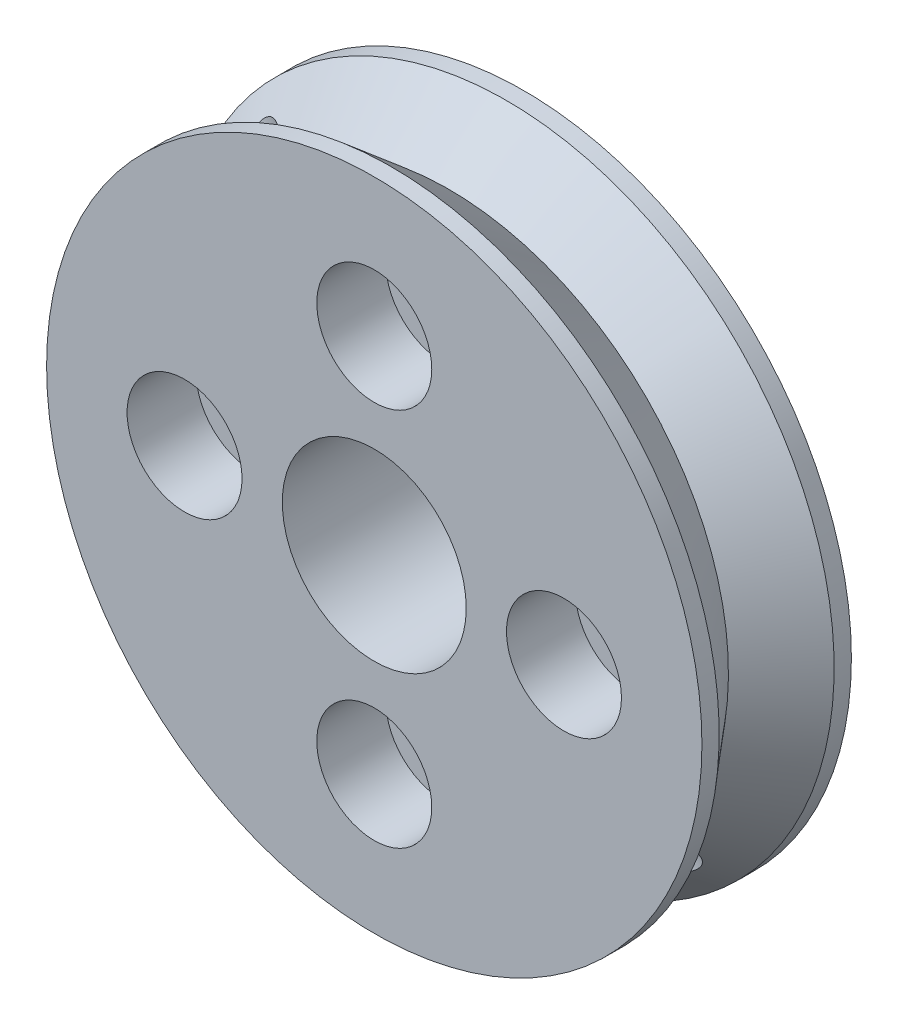
ISO-10303-21;
HEADER;
FILE_DESCRIPTION(('STEP AP214'),'2;1');
FILE_NAME('part.step','',(''),(''),'','','');
FILE_SCHEMA(('AUTOMOTIVE_DESIGN { 1 0 10303 214 1 1 1 1 }'));
ENDSEC;
DATA;
#1=APPLICATION_CONTEXT('core data for automotive mechanical design processes');
#2=APPLICATION_PROTOCOL_DEFINITION('international standard','automotive_design',2000,#1);
#3=PRODUCT_CONTEXT('',#1,'mechanical');
#4=PRODUCT('Part','Part','',(#3));
#5=PRODUCT_RELATED_PRODUCT_CATEGORY('part','',(#4));
#6=PRODUCT_DEFINITION_FORMATION('','',#4);
#7=PRODUCT_DEFINITION_CONTEXT('part definition',#1,'design');
#8=PRODUCT_DEFINITION('design','',#6,#7);
#9=PRODUCT_DEFINITION_SHAPE('','',#8);
#10=(LENGTH_UNIT() NAMED_UNIT(*) SI_UNIT(.MILLI.,.METRE.));
#11=(NAMED_UNIT(*) PLANE_ANGLE_UNIT() SI_UNIT($,.RADIAN.));
#12=(NAMED_UNIT(*) SI_UNIT($,.STERADIAN.) SOLID_ANGLE_UNIT());
#13=UNCERTAINTY_MEASURE_WITH_UNIT(LENGTH_MEASURE(1.E-05),#10,'distance_accuracy_value','');
#14=(GEOMETRIC_REPRESENTATION_CONTEXT(3) GLOBAL_UNCERTAINTY_ASSIGNED_CONTEXT((#13)) GLOBAL_UNIT_ASSIGNED_CONTEXT((#10,
#11,#12)) REPRESENTATION_CONTEXT('',''));
#15=CARTESIAN_POINT('',(0.,0.,0.));
#16=DIRECTION('',(0.,0.,1.));
#17=DIRECTION('',(1.,0.,0.));
#18=AXIS2_PLACEMENT_3D('',#15,#16,#17);
#19=CARTESIAN_POINT('',(0.,-8.25,3.25));
#20=DIRECTION('',(0.,0.,-1.));
#21=DIRECTION('',(-1.,0.,0.));
#22=AXIS2_PLACEMENT_3D('',#19,#20,#21);
#23=CYLINDRICAL_SURFACE('',#22,1.7);
#24=CARTESIAN_POINT('',(0.,-8.25,-3.25));
#25=DIRECTION('',(0.,0.,1.));
#26=DIRECTION('',(1.,0.,0.));
#27=AXIS2_PLACEMENT_3D('',#24,#25,#26);
#28=CIRCLE('',#27,1.7);
#29=CARTESIAN_POINT('',(1.7,-8.25,-3.25));
#30=VERTEX_POINT('',#29);
#31=EDGE_CURVE('E138',#30,#30,#28,.T.);
#32=ORIENTED_EDGE('',*,*,#31,.F.);
#33=EDGE_LOOP('',(#32));
#34=FACE_BOUND('',#33,.T.);
#35=CARTESIAN_POINT('',(0.,-8.25,0.25));
#36=DIRECTION('',(0.,0.,1.));
#37=DIRECTION('',(1.,0.,0.));
#38=AXIS2_PLACEMENT_3D('',#35,#36,#37);
#39=CIRCLE('',#38,1.7);
#40=CARTESIAN_POINT('',(1.7,-8.25,0.25));
#41=VERTEX_POINT('',#40);
#42=EDGE_CURVE('E43',#41,#41,#39,.F.);
#43=ORIENTED_EDGE('',*,*,#42,.F.);
#44=EDGE_LOOP('',(#43));
#45=FACE_BOUND('',#44,.T.);
#46=ADVANCED_FACE('F39',(#34,#45),#23,.F.);
#47=CARTESIAN_POINT('',(-8.25,0.,3.25));
#48=DIRECTION('',(0.,0.,-1.));
#49=DIRECTION('',(-1.,0.,0.));
#50=AXIS2_PLACEMENT_3D('',#47,#48,#49);
#51=CYLINDRICAL_SURFACE('',#50,1.7);
#52=CARTESIAN_POINT('',(-8.25,0.,-3.25));
#53=DIRECTION('',(0.,0.,1.));
#54=DIRECTION('',(1.,0.,0.));
#55=AXIS2_PLACEMENT_3D('',#52,#53,#54);
#56=CIRCLE('',#55,1.7);
#57=CARTESIAN_POINT('',(-6.55,0.,-3.25));
#58=VERTEX_POINT('',#57);
#59=EDGE_CURVE('E135',#58,#58,#56,.T.);
#60=ORIENTED_EDGE('',*,*,#59,.F.);
#61=EDGE_LOOP('',(#60));
#62=FACE_BOUND('',#61,.T.);
#63=CARTESIAN_POINT('',(-8.25,0.,0.25));
#64=DIRECTION('',(0.,0.,1.));
#65=DIRECTION('',(1.,0.,0.));
#66=AXIS2_PLACEMENT_3D('',#63,#64,#65);
#67=CIRCLE('',#66,1.7);
#68=CARTESIAN_POINT('',(-6.55,0.,0.25));
#69=VERTEX_POINT('',#68);
#70=EDGE_CURVE('E185',#69,#69,#67,.F.);
#71=ORIENTED_EDGE('',*,*,#70,.F.);
#72=EDGE_LOOP('',(#71));
#73=FACE_BOUND('',#72,.T.);
#74=ADVANCED_FACE('F101',(#62,#73),#51,.F.);
#75=CARTESIAN_POINT('',(0.,8.25,3.25));
#76=DIRECTION('',(0.,0.,-1.));
#77=DIRECTION('',(-1.,0.,0.));
#78=AXIS2_PLACEMENT_3D('',#75,#76,#77);
#79=CYLINDRICAL_SURFACE('',#78,1.7);
#80=CARTESIAN_POINT('',(0.,8.25,-3.25));
#81=DIRECTION('',(0.,0.,1.));
#82=DIRECTION('',(1.,0.,0.));
#83=AXIS2_PLACEMENT_3D('',#80,#81,#82);
#84=CIRCLE('',#83,1.7);
#85=CARTESIAN_POINT('',(1.7,8.25,-3.25));
#86=VERTEX_POINT('',#85);
#87=EDGE_CURVE('E131',#86,#86,#84,.T.);
#88=ORIENTED_EDGE('',*,*,#87,.F.);
#89=EDGE_LOOP('',(#88));
#90=FACE_BOUND('',#89,.T.);
#91=CARTESIAN_POINT('',(0.,8.25,0.25));
#92=DIRECTION('',(0.,0.,1.));
#93=DIRECTION('',(1.,0.,0.));
#94=AXIS2_PLACEMENT_3D('',#91,#92,#93);
#95=CIRCLE('',#94,1.7);
#96=CARTESIAN_POINT('',(1.7,8.25,0.25));
#97=VERTEX_POINT('',#96);
#98=EDGE_CURVE('E182',#97,#97,#95,.F.);
#99=ORIENTED_EDGE('',*,*,#98,.F.);
#100=EDGE_LOOP('',(#99));
#101=FACE_BOUND('',#100,.T.);
#102=ADVANCED_FACE('F107',(#90,#101),#79,.F.);
#103=CARTESIAN_POINT('',(8.25,0.,3.25));
#104=DIRECTION('',(0.,0.,-1.));
#105=DIRECTION('',(-1.,0.,0.));
#106=AXIS2_PLACEMENT_3D('',#103,#104,#105);
#107=CYLINDRICAL_SURFACE('',#106,1.7);
#108=CARTESIAN_POINT('',(8.25,0.,-3.25));
#109=DIRECTION('',(0.,0.,1.));
#110=DIRECTION('',(1.,0.,0.));
#111=AXIS2_PLACEMENT_3D('',#108,#109,#110);
#112=CIRCLE('',#111,1.7);
#113=CARTESIAN_POINT('',(9.95,0.,-3.25));
#114=VERTEX_POINT('',#113);
#115=EDGE_CURVE('E127',#114,#114,#112,.T.);
#116=ORIENTED_EDGE('',*,*,#115,.F.);
#117=EDGE_LOOP('',(#116));
#118=FACE_BOUND('',#117,.T.);
#119=CARTESIAN_POINT('',(8.25,0.,0.25));
#120=DIRECTION('',(0.,0.,1.));
#121=DIRECTION('',(1.,0.,0.));
#122=AXIS2_PLACEMENT_3D('',#119,#120,#121);
#123=CIRCLE('',#122,1.7);
#124=CARTESIAN_POINT('',(9.95,0.,0.25));
#125=VERTEX_POINT('',#124);
#126=EDGE_CURVE('E186',#125,#125,#123,.F.);
#127=ORIENTED_EDGE('',*,*,#126,.F.);
#128=EDGE_LOOP('',(#127));
#129=FACE_BOUND('',#128,.T.);
#130=ADVANCED_FACE('F171',(#118,#129),#107,.F.);
#131=CARTESIAN_POINT('',(0.,0.,3.25));
#132=DIRECTION('',(0.,0.,-1.));
#133=DIRECTION('',(-1.,0.,0.));
#134=AXIS2_PLACEMENT_3D('',#131,#132,#133);
#135=CYLINDRICAL_SURFACE('',#134,14.25);
#136=CARTESIAN_POINT('',(0.,0.,-3.25));
#137=DIRECTION('',(0.,0.,1.));
#138=DIRECTION('',(1.,0.,0.));
#139=AXIS2_PLACEMENT_3D('',#136,#137,#138);
#140=CIRCLE('',#139,14.25);
#141=CARTESIAN_POINT('',(14.25,0.,-3.25));
#142=VERTEX_POINT('',#141);
#143=EDGE_CURVE('E141',#142,#142,#140,.T.);
#144=ORIENTED_EDGE('',*,*,#143,.T.);
#145=EDGE_LOOP('',(#144));
#146=FACE_BOUND('',#145,.T.);
#147=CARTESIAN_POINT('',(0.,0.,-2.5));
#148=DIRECTION('',(0.,0.,-1.));
#149=DIRECTION('',(-1.,0.,0.));
#150=AXIS2_PLACEMENT_3D('',#147,#148,#149);
#151=CIRCLE('',#150,14.25);
#152=CARTESIAN_POINT('',(-14.25,0.,-2.5));
#153=VERTEX_POINT('',#152);
#154=EDGE_CURVE('E236',#153,#153,#151,.T.);
#155=ORIENTED_EDGE('',*,*,#154,.T.);
#156=EDGE_LOOP('',(#155));
#157=FACE_BOUND('',#156,.T.);
#158=ADVANCED_FACE('F41',(#146,#157),#135,.T.);
#159=CARTESIAN_POINT('',(0.,0.,3.25));
#160=DIRECTION('',(0.,0.,1.));
#161=DIRECTION('',(1.,0.,0.));
#162=AXIS2_PLACEMENT_3D('',#159,#160,#161);
#163=CIRCLE('',#162,14.25);
#164=CARTESIAN_POINT('',(14.25,0.,3.25));
#165=VERTEX_POINT('',#164);
#166=EDGE_CURVE('E71',#165,#165,#163,.T.);
#167=ORIENTED_EDGE('',*,*,#166,.F.);
#168=EDGE_LOOP('',(#167));
#169=FACE_BOUND('',#168,.T.);
#170=CARTESIAN_POINT('',(0.,0.,2.5));
#171=DIRECTION('',(0.,0.,-1.));
#172=DIRECTION('',(-1.,0.,0.));
#173=AXIS2_PLACEMENT_3D('',#170,#171,#172);
#174=CIRCLE('',#173,14.25);
#175=CARTESIAN_POINT('',(-14.25,0.,2.5));
#176=VERTEX_POINT('',#175);
#177=EDGE_CURVE('E79',#176,#176,#174,.T.);
#178=ORIENTED_EDGE('',*,*,#177,.F.);
#179=EDGE_LOOP('',(#178));
#180=FACE_BOUND('',#179,.T.);
#181=ADVANCED_FACE('F94',(#169,#180),#135,.T.);
#182=CARTESIAN_POINT('',(-14.2499999999999,14.2500000000001,0.));
#183=DIRECTION('',(0.707106781186542,-0.707106781186554,0.));
#184=DIRECTION('',(0.707106781186554,0.707106781186542,0.));
#185=AXIS2_PLACEMENT_3D('',#182,#183,#184);
#186=CYLINDRICAL_SURFACE('',#185,1.4);
#187=CARTESIAN_POINT('',(3.63947775355951,-1.65957876623723,0.));
#188=CARTESIAN_POINT('',(3.63947788611536,-1.65957716975627,0.0760060913772673));
#189=CARTESIAN_POINT('',(3.63673946082005,-1.66562327320794,0.152003666512723));
#190=CARTESIAN_POINT('',(3.62575133125318,-1.68940690467713,0.301731690751213));
#191=CARTESIAN_POINT('',(3.61750116905998,-1.70714540411112,0.375461950950603));
#192=CARTESIAN_POINT('',(3.59540903450762,-1.75319076836715,0.518458673443775));
#193=CARTESIAN_POINT('',(3.58157894045541,-1.7814751738971,0.587734257722022));
#194=CARTESIAN_POINT('',(3.54816192307589,-1.84713271589594,0.720330706961884));
#195=CARTESIAN_POINT('',(3.52857353591859,-1.88450816300364,0.783650052363904));
#196=CARTESIAN_POINT('',(3.48255926605917,-1.96828560280359,0.905271446713055));
#197=CARTESIAN_POINT('',(3.45589525150277,-2.01498423610397,0.963279137534918));
#198=CARTESIAN_POINT('',(3.39596565053636,-2.11442276463167,1.06997499761331));
#199=CARTESIAN_POINT('',(3.36269887925282,-2.16716374344676,1.11866149108331));
#200=CARTESIAN_POINT('',(3.28848514892996,-2.27825572753737,1.20670005156797));
#201=CARTESIAN_POINT('',(3.24734285642484,-2.33672532769894,1.24573923603048));
#202=CARTESIAN_POINT('',(3.15840699983615,-2.4555986165656,1.31129584709942));
#203=CARTESIAN_POINT('',(3.1106154304801,-2.51600172106694,1.33781701856315));
#204=CARTESIAN_POINT('',(3.0111834618099,-2.63410384668441,1.37657343099056));
#205=CARTESIAN_POINT('',(2.9597587299749,-2.69181829964504,1.38931389802083));
#206=CARTESIAN_POINT('',(2.85286862465806,-2.80485007673732,1.40175847012769));
#207=CARTESIAN_POINT('',(2.79740440165374,-2.86016807629417,1.40146627262204));
#208=CARTESIAN_POINT('',(2.68663329450503,-2.96437835617514,1.38816415346179));
#209=CARTESIAN_POINT('',(2.63142305198567,-3.01344496571013,1.37570398786468));
#210=CARTESIAN_POINT('',(2.52065825099104,-3.10669051060959,1.33933478883097));
#211=CARTESIAN_POINT('',(2.46510366891711,-3.15086910698329,1.31542496195572));
#212=CARTESIAN_POINT('',(2.35472889996983,-3.23420842028166,1.25654027871546));
#213=CARTESIAN_POINT('',(2.29992937945607,-3.27329160946798,1.22141749919883));
#214=CARTESIAN_POINT('',(2.19372187436958,-3.34540149514565,1.14122901867042));
#215=CARTESIAN_POINT('',(2.14231490308241,-3.37842638734163,1.09616036433163));
#216=CARTESIAN_POINT('',(2.04218698102348,-3.43992773804009,0.994635141240734));
#217=CARTESIAN_POINT('',(1.9937412281221,-3.46808184037123,0.937711185982945));
#218=CARTESIAN_POINT('',(1.90464439807046,-3.5178031795848,0.815478406493404));
#219=CARTESIAN_POINT('',(1.86399479264564,-3.53936917324513,0.750168002978949));
#220=CARTESIAN_POINT('',(1.79184441999284,-3.57644703788225,0.611551972355263));
#221=CARTESIAN_POINT('',(1.76051230183362,-3.59184887259228,0.538128550796498));
#222=CARTESIAN_POINT('',(1.7098158670291,-3.61625922983092,0.38626346059649));
#223=CARTESIAN_POINT('',(1.6904459109066,-3.62527076531872,0.307824175926177));
#224=CARTESIAN_POINT('',(1.66560070124844,-3.63675040530604,0.152281300172023));
#225=CARTESIAN_POINT('',(1.65948951557399,-3.639518255677,0.0753014409578754));
#226=CARTESIAN_POINT('',(1.65966994027411,-3.63943637435514,-0.0786316642045612));
#227=CARTESIAN_POINT('',(1.66595899093495,-3.63658780203009,-0.155584912366397));
#228=CARTESIAN_POINT('',(1.69002551657347,-3.62546210440793,-0.304127247344445));
#229=CARTESIAN_POINT('',(1.70734274764287,-3.61740226584294,-0.375808346770403));
#230=CARTESIAN_POINT('',(1.75203214113332,-3.59596902530902,-0.515121227583017));
#231=CARTESIAN_POINT('',(1.77940619770845,-3.58259462232903,-0.582752243363609));
#232=CARTESIAN_POINT('',(1.84392358703916,-3.54983009794742,-0.714603777668174));
#233=CARTESIAN_POINT('',(1.88136816697597,-3.53025042751184,-0.778629411348126));
#234=CARTESIAN_POINT('',(1.96383687670407,-3.48504701236031,-0.899243379425569));
#235=CARTESIAN_POINT('',(2.00886345640405,-3.45942131296415,-0.955829299332018));
#236=CARTESIAN_POINT('',(2.10729098178688,-3.40040966502153,-1.06311491416967));
#237=CARTESIAN_POINT('',(2.16101251484198,-3.36667985767456,-1.11333287705775));
#238=CARTESIAN_POINT('',(2.27271128094015,-3.29230604884668,-1.20272072106339));
#239=CARTESIAN_POINT('',(2.3306884150722,-3.25166220803664,-1.24189085885819));
#240=CARTESIAN_POINT('',(2.44831627393176,-3.16403061699532,-1.30774170435537));
#241=CARTESIAN_POINT('',(2.50795566169806,-3.11708009609219,-1.33449188413042));
#242=CARTESIAN_POINT('',(2.62693128260439,-3.01748884388866,-1.3748102323871));
#243=CARTESIAN_POINT('',(2.68626762817928,-2.96485041223458,-1.38838370627018));
#244=CARTESIAN_POINT('',(2.79946980482254,-2.85809567944846,-1.40144816504143));
#245=CARTESIAN_POINT('',(2.85346003008803,-2.80419469303981,-1.40162765138887));
#246=CARTESIAN_POINT('',(2.95760622195815,-2.69412405133208,-1.38962556150099));
#247=CARTESIAN_POINT('',(3.00776255461261,-2.63795461340329,-1.37744516694324));
#248=CARTESIAN_POINT('',(3.10212408165155,-2.52627688770917,-1.34153812325355));
#249=CARTESIAN_POINT('',(3.14642422707418,-2.47077631010416,-1.31803520806681));
#250=CARTESIAN_POINT('',(3.22947510786148,-2.36119095730419,-1.26036291606221));
#251=CARTESIAN_POINT('',(3.26822480956707,-2.30710644735211,-1.22619155621779));
#252=CARTESIAN_POINT('',(3.34125032246574,-2.20009278303812,-1.14661824681527));
#253=CARTESIAN_POINT('',(3.37529145903147,-2.14729185020974,-1.10082884760398));
#254=CARTESIAN_POINT('',(3.43698795785791,-2.04709119745253,-0.999958933749432));
#255=CARTESIAN_POINT('',(3.46464117278362,-1.99969329648676,-0.94487530553615));
#256=CARTESIAN_POINT('',(3.5147829202205,-1.91024847309414,-0.824065163914138));
#257=CARTESIAN_POINT('',(3.53698794089197,-1.86853217790949,-0.75797493356523));
#258=CARTESIAN_POINT('',(3.57480022824283,-1.7951366166433,-0.618700914273428));
#259=CARTESIAN_POINT('',(3.59040834885774,-1.76345605162006,-0.545518044945527));
#260=CARTESIAN_POINT('',(3.61510049733565,-1.71226577384796,-0.394878281224767));
#261=CARTESIAN_POINT('',(3.62425491899729,-1.69262505466233,-0.317477749380293));
#262=CARTESIAN_POINT('',(3.63644210279996,-1.66628529708503,-0.160047533869541));
#263=CARTESIAN_POINT('',(3.639477614005,-1.65958044700889,-0.0800190473048831));
#264=CARTESIAN_POINT('',(3.63947775355951,-1.65957876623723,0.));
#265=B_SPLINE_CURVE_WITH_KNOTS('',3,(#187,#188,#189,#190,#191,#192,#193,#194,#195,#196,#197,
#198,#199,#200,#201,#202,#203,#204,#205,#206,#207,#208,#209,#210,#211,#212,#213,#214,#215,#216,
#217,#218,#219,#220,#221,#222,#223,#224,#225,#226,#227,#228,#229,#230,#231,#232,#233,#234,#235,
#236,#237,#238,#239,#240,#241,#242,#243,#244,#245,#246,#247,#248,#249,#250,#251,#252,#253,#254,
#255,#256,#257,#258,#259,#260,#261,#262,#263,#264),.UNSPECIFIED.,.T.,.F.,(4,2,2,2,2,2,2,2,2,2,2,
2,2,2,2,2,2,2,2,2,2,2,2,2,2,2,2,2,2,2,2,2,2,2,2,2,2,2,4),(0.,0.227721308475359,
0.455461538659763,0.682719502323081,0.910035287830709,1.14627052827175,1.3825481998336,
1.62570198917555,1.8687829910648,2.10261389235607,2.33637845533114,2.56004796521567,
2.78373297719376,3.01050009443987,3.23733463871139,3.47586603961667,3.71444242529663,
3.95710565561087,4.19965439654246,4.43028591348695,4.66086982739881,4.88241035498192,
5.10399263005356,5.3331293378953,5.56234022735559,5.80390693258595,6.04546802496657,
6.2856611448589,6.52575751446145,6.75350304980482,6.9812268133821,7.20462462215142,
7.42806398035223,7.66025483630845,7.89252363128308,8.13509557321962,8.37763610581469,
8.61748838623404,8.85723288335298),.UNSPECIFIED.);
#266=CARTESIAN_POINT('',(3.63947775355951,-1.65957876623723,0.));
#267=VERTEX_POINT('',#266);
#268=EDGE_CURVE('E158',#267,#267,#265,.T.);
#269=ORIENTED_EDGE('',*,*,#268,.F.);
#270=EDGE_LOOP('',(#269));
#271=FACE_BOUND('',#270,.T.);
#272=CARTESIAN_POINT('',(9.43753108702619,-7.4675849151729,0.14019999999997));
#273=CARTESIAN_POINT('',(9.46734965577651,-7.49098429448374,0.0950264309316864));
#274=CARTESIAN_POINT('',(9.4957823363307,-7.51611769843548,0.0498705369338458));
#275=CARTESIAN_POINT('',(9.54978019748563,-7.5696704756696,-0.040200520438273));
#276=CARTESIAN_POINT('',(9.57534564227704,-7.59808954571578,-0.0851157056280187));
#277=CARTESIAN_POINT('',(9.64798525452429,-7.6884817986624,-0.219909502325278));
#278=CARTESIAN_POINT('',(9.69052924256376,-7.75521580119698,-0.309117697395798));
#279=CARTESIAN_POINT('',(9.76718340475337,-7.90979430672398,-0.495783180606125));
#280=CARTESIAN_POINT('',(9.79933475899052,-7.99927909967803,-0.59269230975932));
#281=CARTESIAN_POINT('',(9.84333232059952,-8.19070447707615,-0.778252106736865));
#282=CARTESIAN_POINT('',(9.85525013262265,-8.29259976360864,-0.866930843111174));
#283=CARTESIAN_POINT('',(9.8545926939759,-8.4654393554997,-0.9999521089026));
#284=CARTESIAN_POINT('',(9.84962826271485,-8.5333575576846,-1.04830048747714));
#285=CARTESIAN_POINT('',(9.82888242859464,-8.67190468610074,-1.13836846417113));
#286=CARTESIAN_POINT('',(9.81311797574277,-8.74252920119541,-1.18009832346961));
#287=CARTESIAN_POINT('',(9.77366804064787,-8.87083532604728,-1.24745626487307));
#288=CARTESIAN_POINT('',(9.75212765519881,-8.92835421234267,-1.27463740246337));
#289=CARTESIAN_POINT('',(9.70061916891676,-9.04257642972078,-1.32192001269676));
#290=CARTESIAN_POINT('',(9.67065538504984,-9.09928016296081,-1.34202509993934));
#291=CARTESIAN_POINT('',(9.60199584093452,-9.21040850248468,-1.3739188863474));
#292=CARTESIAN_POINT('',(9.56323196187327,-9.2648111769175,-1.38563957853349));
#293=CARTESIAN_POINT('',(9.47796705743104,-9.36853152352961,-1.39946843186714));
#294=CARTESIAN_POINT('',(9.43147213365703,-9.41785315651427,-1.40158413662394));
#295=CARTESIAN_POINT('',(9.33900793552611,-9.50339491415079,-1.3963989308437));
#296=CARTESIAN_POINT('',(9.29376615594782,-9.54048490321998,-1.39029411430235));
#297=CARTESIAN_POINT('',(9.20022780912705,-9.60847761977367,-1.37113813985493));
#298=CARTESIAN_POINT('',(9.15193088154649,-9.63937961562086,-1.35808616121783));
#299=CARTESIAN_POINT('',(9.05302425400683,-9.69506326468632,-1.32559218958881));
#300=CARTESIAN_POINT('',(9.00239120670539,-9.71974993238832,-1.30606050546355));
#301=CARTESIAN_POINT('',(8.90072963567944,-9.76255224180034,-1.26164141764392));
#302=CARTESIAN_POINT('',(8.84970093135849,-9.78066467741327,-1.236751410223));
#303=CARTESIAN_POINT('',(8.72341297073871,-9.81804410301845,-1.1693180906493));
#304=CARTESIAN_POINT('',(8.6484738160744,-9.8335660392111,-1.12408540774541));
#305=CARTESIAN_POINT('',(8.50182155387668,-9.85262558630537,-1.0264064403747));
#306=CARTESIAN_POINT('',(8.43011615618018,-9.85613591092636,-0.973944013019302));
#307=CARTESIAN_POINT('',(8.26853973821625,-9.85220709115613,-0.845797110092847));
#308=CARTESIAN_POINT('',(8.1803563697062,-9.84083041709052,-0.768113552399643));
#309=CARTESIAN_POINT('',(8.01342491915921,-9.80270723899653,-0.606510228120875));
#310=CARTESIAN_POINT('',(7.93469363281545,-9.77593385076939,-0.522579777579706));
#311=CARTESIAN_POINT('',(7.82158236264099,-9.72434061202671,-0.39007958229217));
#312=CARTESIAN_POINT('',(7.78336636208185,-9.70421108492633,-0.342863171327817));
#313=CARTESIAN_POINT('',(7.71030624015635,-9.66023003162617,-0.247539703294428));
#314=CARTESIAN_POINT('',(7.67546238391243,-9.63637821315945,-0.199432576549792));
#315=CARTESIAN_POINT('',(7.60954990672717,-9.58528393936149,-0.102881798101448));
#316=CARTESIAN_POINT('',(7.57846244978679,-9.5580599170859,-0.0544412332825799));
#317=CARTESIAN_POINT('',(7.52010236698921,-9.50026824548891,0.0427312254067125));
#318=CARTESIAN_POINT('',(7.49282928803658,-9.46970099406697,0.0914630839571558));
#319=CARTESIAN_POINT('',(7.46758491517272,-9.4375310870263,0.140200000000001));
#320=B_SPLINE_CURVE_WITH_KNOTS('',3,(#272,#273,#274,#275,#276,#277,#278,#279,#280,#281,#282,
#283,#284,#285,#286,#287,#288,#289,#290,#291,#292,#293,#294,#295,#296,#297,#298,#299,#300,#301,
#302,#303,#304,#305,#306,#307,#308,#309,#310,#311,#312,#313,#314,#315,#316,#317,#318,#319),
.UNSPECIFIED.,.F.,.F.,(4,2,2,2,2,2,2,2,2,2,2,2,2,2,2,2,2,2,2,2,2,2,2,4),(0.,0.176815457380836,
0.353614609358182,0.710000790584395,1.11529838666654,1.51915865868001,1.7689131605813,
2.01827658254899,2.21899547986618,2.41961169630763,2.62183723518224,2.82390392172509,
2.99952666227456,3.17517015533208,3.35335405464546,3.53162473363866,3.79683871151728,
4.06265476647018,4.41502523321876,4.76801285023159,4.95981851604573,5.15163924964514,
5.3424542522406,5.53324656936292),.UNSPECIFIED.);
#321=CARTESIAN_POINT('',(9.52567449135846,-7.54577550403627,0.));
#322=VERTEX_POINT('',#321);
#323=CARTESIAN_POINT('',(7.5457755040358,-9.52567449135878,0.));
#324=VERTEX_POINT('',#323);
#325=EDGE_CURVE('E76',#322,#324,#320,.T.);
#326=ORIENTED_EDGE('',*,*,#325,.F.);
#327=CARTESIAN_POINT('',(7.46758491517272,-9.4375310870263,-0.140199999999999));
#328=CARTESIAN_POINT('',(7.49098429448356,-9.46734965577662,-0.0950264309317154));
#329=CARTESIAN_POINT('',(7.5161176984353,-9.49578233633081,-0.0498705369338746));
#330=CARTESIAN_POINT('',(7.56967047566942,-9.54978019748575,0.040200520438244));
#331=CARTESIAN_POINT('',(7.5980895457156,-9.57534564227715,0.0851157056279895));
#332=CARTESIAN_POINT('',(7.68848179866221,-9.64798525452441,0.21990950232525));
#333=CARTESIAN_POINT('',(7.75521580119679,-9.69052924256387,0.309117697395771));
#334=CARTESIAN_POINT('',(7.90979430672379,-9.7671834047535,0.495783180606099));
#335=CARTESIAN_POINT('',(7.99927909967784,-9.79933475899065,0.592692309759294));
#336=CARTESIAN_POINT('',(8.19070447707595,-9.84333232059965,0.778252106736838));
#337=CARTESIAN_POINT('',(8.29259976360844,-9.85525013262278,0.866930843111146));
#338=CARTESIAN_POINT('',(8.4654393554995,-9.85459269397605,0.999952108902576));
#339=CARTESIAN_POINT('',(8.5333575576844,-9.849628262715,1.04830048747712));
#340=CARTESIAN_POINT('',(8.67190468610054,-9.82888242859479,1.13836846417111));
#341=CARTESIAN_POINT('',(8.74252920119521,-9.81311797574293,1.18009832346959));
#342=CARTESIAN_POINT('',(8.87083532604709,-9.77366804064803,1.24745626487306));
#343=CARTESIAN_POINT('',(8.92835421234248,-9.75212765519897,1.27463740246336));
#344=CARTESIAN_POINT('',(9.04257642972058,-9.70061916891693,1.32192001269675));
#345=CARTESIAN_POINT('',(9.09928016296061,-9.67065538505001,1.34202509993933));
#346=CARTESIAN_POINT('',(9.21040850248449,-9.60199584093469,1.3739188863474));
#347=CARTESIAN_POINT('',(9.26481117691731,-9.56323196187345,1.38563957853348));
#348=CARTESIAN_POINT('',(9.36853152352942,-9.47796705743122,1.39946843186714));
#349=CARTESIAN_POINT('',(9.41785315651409,-9.43147213365721,1.40158413662394));
#350=CARTESIAN_POINT('',(9.5033949141506,-9.3390079355263,1.3963989308437));
#351=CARTESIAN_POINT('',(9.5404849032198,-9.293766155948,1.39029411430235));
#352=CARTESIAN_POINT('',(9.6084776197735,-9.20022780912723,1.37113813985494));
#353=CARTESIAN_POINT('',(9.63937961562069,-9.15193088154667,1.35808616121783));
#354=CARTESIAN_POINT('',(9.69506326468616,-9.05302425400702,1.32559218958881));
#355=CARTESIAN_POINT('',(9.71974993238815,-9.00239120670558,1.30606050546356));
#356=CARTESIAN_POINT('',(9.76255224180017,-8.90072963567963,1.26164141764393));
#357=CARTESIAN_POINT('',(9.7806646774131,-8.84970093135868,1.23675141022302));
#358=CARTESIAN_POINT('',(9.81804410301829,-8.72341297073891,1.16931809064931));
#359=CARTESIAN_POINT('',(9.83356603921095,-8.6484738160746,1.12408540774543));
#360=CARTESIAN_POINT('',(9.85262558630522,-8.50182155387688,1.02640644037472));
#361=CARTESIAN_POINT('',(9.85613591092621,-8.43011615618038,0.973944013019328));
#362=CARTESIAN_POINT('',(9.85220709115599,-8.26853973821646,0.845797110092878));
#363=CARTESIAN_POINT('',(9.84083041709038,-8.18035636970641,0.768113552399679));
#364=CARTESIAN_POINT('',(9.80270723899641,-8.01342491915942,0.606510228120919));
#365=CARTESIAN_POINT('',(9.77593385076928,-7.93469363281565,0.522579777579754));
#366=CARTESIAN_POINT('',(9.7243406120266,-7.82158236264119,0.39007958229222));
#367=CARTESIAN_POINT('',(9.70421108492622,-7.78336636208206,0.342863171327865));
#368=CARTESIAN_POINT('',(9.66023003162606,-7.71030624015655,0.247539703294473));
#369=CARTESIAN_POINT('',(9.63637821315934,-7.67546238391263,0.199432576549836));
#370=CARTESIAN_POINT('',(9.58528393936138,-7.60954990672736,0.102881798101489));
#371=CARTESIAN_POINT('',(9.55805991708579,-7.57846244978698,0.0544412332826179));
#372=CARTESIAN_POINT('',(9.50026824548881,-7.52010236698939,-0.0427312254066793));
#373=CARTESIAN_POINT('',(9.46970099406686,-7.49282928803676,-0.0914630839571246));
#374=CARTESIAN_POINT('',(9.43753108702619,-7.4675849151729,-0.140199999999971));
#375=B_SPLINE_CURVE_WITH_KNOTS('',3,(#327,#328,#329,#330,#331,#332,#333,#334,#335,#336,#337,
#338,#339,#340,#341,#342,#343,#344,#345,#346,#347,#348,#349,#350,#351,#352,#353,#354,#355,#356,
#357,#358,#359,#360,#361,#362,#363,#364,#365,#366,#367,#368,#369,#370,#371,#372,#373,#374),
.UNSPECIFIED.,.F.,.F.,(4,2,2,2,2,2,2,2,2,2,2,2,2,2,2,2,2,2,2,2,2,2,2,4),(0.,0.176815457380837,
0.353614609358182,0.710000790584396,1.11529838666654,1.51915865868,1.7689131605813,
2.018276582549,2.21899547986618,2.41961169630764,2.62183723518225,2.82390392172509,
2.99952666227457,3.17517015533208,3.35335405464547,3.53162473363867,3.79683871151727,
4.06265476647016,4.41502523321873,4.76801285023155,4.9598185160457,5.15163924964512,
5.34245425224059,5.53324656936291),.UNSPECIFIED.);
#376=EDGE_CURVE('E217',#324,#322,#375,.T.);
#377=ORIENTED_EDGE('',*,*,#376,.F.);
#378=EDGE_LOOP('',(#326,#377));
#379=FACE_BOUND('',#378,.T.);
#380=ADVANCED_FACE('F84',(#271,#379),#186,.F.);
#381=CARTESIAN_POINT('',(-1.65957876623716,3.63947775355953,0.));
#382=CARTESIAN_POINT('',(-1.6595771697562,3.63947788611538,-0.0760060913772684));
#383=CARTESIAN_POINT('',(-1.66562327320788,3.63673946082008,-0.152003666512723));
#384=CARTESIAN_POINT('',(-1.68940690467707,3.62575133125321,-0.301731690751213));
#385=CARTESIAN_POINT('',(-1.70714540411106,3.61750116906001,-0.375461950950604));
#386=CARTESIAN_POINT('',(-1.75319076836709,3.59540903450765,-0.518458673443776));
#387=CARTESIAN_POINT('',(-1.78147517389704,3.58157894045544,-0.587734257722023));
#388=CARTESIAN_POINT('',(-1.84713271589588,3.54816192307592,-0.720330706961884));
#389=CARTESIAN_POINT('',(-1.88450816300358,3.52857353591862,-0.783650052363903));
#390=CARTESIAN_POINT('',(-1.96828560280353,3.4825592660592,-0.905271446713054));
#391=CARTESIAN_POINT('',(-2.01498423610391,3.45589525150281,-0.963279137534918));
#392=CARTESIAN_POINT('',(-2.11442276463162,3.39596565053639,-1.06997499761331));
#393=CARTESIAN_POINT('',(-2.1671637434467,3.36269887925286,-1.11866149108331));
#394=CARTESIAN_POINT('',(-2.27825572753732,3.28848514893,-1.20670005156797));
#395=CARTESIAN_POINT('',(-2.33672532769888,3.24734285642488,-1.24573923603048));
#396=CARTESIAN_POINT('',(-2.45559861656554,3.15840699983619,-1.31129584709942));
#397=CARTESIAN_POINT('',(-2.51600172106688,3.11061543048014,-1.33781701856315));
#398=CARTESIAN_POINT('',(-2.63410384668435,3.01118346180995,-1.37657343099056));
#399=CARTESIAN_POINT('',(-2.69181829964499,2.95975872997495,-1.38931389802083));
#400=CARTESIAN_POINT('',(-2.80485007673727,2.85286862465811,-1.4017584701277));
#401=CARTESIAN_POINT('',(-2.86016807629412,2.7974044016538,-1.40146627262204));
#402=CARTESIAN_POINT('',(-2.96437835617509,2.68663329450508,-1.38816415346179));
#403=CARTESIAN_POINT('',(-3.01344496571008,2.63142305198573,-1.37570398786468));
#404=CARTESIAN_POINT('',(-3.10669051060954,2.5206582509911,-1.33933478883098));
#405=CARTESIAN_POINT('',(-3.15086910698325,2.46510366891716,-1.31542496195573));
#406=CARTESIAN_POINT('',(-3.23420842028162,2.35472889996988,-1.25654027871546));
#407=CARTESIAN_POINT('',(-3.27329160946794,2.29992937945612,-1.22141749919883));
#408=CARTESIAN_POINT('',(-3.34540149514561,2.19372187436964,-1.14122901867042));
#409=CARTESIAN_POINT('',(-3.3784263873416,2.14231490308247,-1.09616036433163));
#410=CARTESIAN_POINT('',(-3.43992773804006,2.04218698102354,-0.994635141240736));
#411=CARTESIAN_POINT('',(-3.4680818403712,1.99374122812216,-0.937711185982947));
#412=CARTESIAN_POINT('',(-3.51780317958477,1.90464439807052,-0.815478406493406));
#413=CARTESIAN_POINT('',(-3.5393691732451,1.8639947926457,-0.750168002978951));
#414=CARTESIAN_POINT('',(-3.57644703788222,1.7918444199929,-0.611551972355265));
#415=CARTESIAN_POINT('',(-3.59184887259226,1.76051230183368,-0.5381285507965));
#416=CARTESIAN_POINT('',(-3.61625922983089,1.70981586702916,-0.386263460596491));
#417=CARTESIAN_POINT('',(-3.62527076531869,1.69044591090666,-0.307824175926179));
#418=CARTESIAN_POINT('',(-3.63675040530602,1.6656007012485,-0.152281300172025));
#419=CARTESIAN_POINT('',(-3.63951825567697,1.65948951557404,-0.075301440957878));
#420=CARTESIAN_POINT('',(-3.63943637435511,1.65966994027417,0.0786316642045582));
#421=CARTESIAN_POINT('',(-3.63658780203007,1.66595899093502,0.155584912366394));
#422=CARTESIAN_POINT('',(-3.6254621044079,1.69002551657353,0.304127247344442));
#423=CARTESIAN_POINT('',(-3.61740226584291,1.70734274764293,0.375808346770401));
#424=CARTESIAN_POINT('',(-3.59596902530899,1.75203214113337,0.515121227583015));
#425=CARTESIAN_POINT('',(-3.582594622329,1.7794061977085,0.582752243363606));
#426=CARTESIAN_POINT('',(-3.54983009794739,1.84392358703921,0.714603777668169));
#427=CARTESIAN_POINT('',(-3.53025042751181,1.88136816697603,0.77862941134812));
#428=CARTESIAN_POINT('',(-3.48504701236028,1.96383687670413,0.899243379425562));
#429=CARTESIAN_POINT('',(-3.45942131296411,2.00886345640411,0.955829299332013));
#430=CARTESIAN_POINT('',(-3.40040966502149,2.10729098178693,1.06311491416967));
#431=CARTESIAN_POINT('',(-3.36667985767452,2.16101251484203,1.11333287705774));
#432=CARTESIAN_POINT('',(-3.29230604884664,2.2727112809402,1.20272072106338));
#433=CARTESIAN_POINT('',(-3.2516622080366,2.33068841507225,1.24189085885819));
#434=CARTESIAN_POINT('',(-3.16403061699528,2.44831627393181,1.30774170435537));
#435=CARTESIAN_POINT('',(-3.11708009609215,2.5079556616981,1.33449188413042));
#436=CARTESIAN_POINT('',(-3.01748884388862,2.62693128260444,1.3748102323871));
#437=CARTESIAN_POINT('',(-2.96485041223454,2.68626762817933,1.38838370627018));
#438=CARTESIAN_POINT('',(-2.85809567944841,2.79946980482259,1.40144816504142));
#439=CARTESIAN_POINT('',(-2.80419469303977,2.85346003008807,1.40162765138887));
#440=CARTESIAN_POINT('',(-2.69412405133204,2.9576062219582,1.38962556150099));
#441=CARTESIAN_POINT('',(-2.63795461340324,3.00776255461265,1.37744516694323));
#442=CARTESIAN_POINT('',(-2.52627688770912,3.10212408165159,1.34153812325355));
#443=CARTESIAN_POINT('',(-2.47077631010411,3.14642422707422,1.31803520806681));
#444=CARTESIAN_POINT('',(-2.36119095730414,3.22947510786152,1.26036291606221));
#445=CARTESIAN_POINT('',(-2.30710644735206,3.26822480956711,1.22619155621778));
#446=CARTESIAN_POINT('',(-2.20009278303807,3.34125032246577,1.14661824681527));
#447=CARTESIAN_POINT('',(-2.14729185020968,3.3752914590315,1.10082884760397));
#448=CARTESIAN_POINT('',(-2.04709119745247,3.43698795785794,0.999958933749433));
#449=CARTESIAN_POINT('',(-1.9996932964867,3.46464117278365,0.944875305536152));
#450=CARTESIAN_POINT('',(-1.91024847309409,3.51478292022053,0.824065163914141));
#451=CARTESIAN_POINT('',(-1.86853217790943,3.536987940892,0.757974933565232));
#452=CARTESIAN_POINT('',(-1.79513661664325,3.57480022824286,0.618700914273427));
#453=CARTESIAN_POINT('',(-1.76345605162,3.59040834885777,0.545518044945526));
#454=CARTESIAN_POINT('',(-1.7122657738479,3.61510049733568,0.394878281224764));
#455=CARTESIAN_POINT('',(-1.69262505466228,3.62425491899732,0.317477749380289));
#456=CARTESIAN_POINT('',(-1.66628529708497,3.63644210279998,0.160047533869537));
#457=CARTESIAN_POINT('',(-1.65958044700882,3.63947761400502,0.0800190473048802));
#458=CARTESIAN_POINT('',(-1.65957876623716,3.63947775355953,0.));
#459=B_SPLINE_CURVE_WITH_KNOTS('',3,(#381,#382,#383,#384,#385,#386,#387,#388,#389,#390,#391,
#392,#393,#394,#395,#396,#397,#398,#399,#400,#401,#402,#403,#404,#405,#406,#407,#408,#409,#410,
#411,#412,#413,#414,#415,#416,#417,#418,#419,#420,#421,#422,#423,#424,#425,#426,#427,#428,#429,
#430,#431,#432,#433,#434,#435,#436,#437,#438,#439,#440,#441,#442,#443,#444,#445,#446,#447,#448,
#449,#450,#451,#452,#453,#454,#455,#456,#457,#458),.UNSPECIFIED.,.T.,.F.,(4,2,2,2,2,2,2,2,2,2,2,
2,2,2,2,2,2,2,2,2,2,2,2,2,2,2,2,2,2,2,2,2,2,2,2,2,2,2,4),(0.,0.227721308475358,
0.455461538659762,0.68271950232308,0.910035287830707,1.14627052827175,1.3825481998336,
1.62570198917555,1.8687829910648,2.10261389235606,2.33637845533114,2.56004796521567,
2.78373297719376,3.01050009443987,3.23733463871139,3.47586603961667,3.71444242529663,
3.95710565561087,4.19965439654246,4.43028591348695,4.66086982739881,4.88241035498192,
5.10399263005356,5.3331293378953,5.56234022735559,5.80390693258595,6.04546802496657,
6.2856611448589,6.52575751446145,6.75350304980482,6.98122681338209,7.20462462215141,
7.42806398035223,7.66025483630845,7.89252363128308,8.13509557321962,8.37763610581469,
8.61748838623404,8.85723288335298),.UNSPECIFIED.);
#460=CARTESIAN_POINT('',(-1.65957876623716,3.63947775355953,0.));
#461=VERTEX_POINT('',#460);
#462=EDGE_CURVE('E165',#461,#461,#459,.T.);
#463=ORIENTED_EDGE('',*,*,#462,.F.);
#464=EDGE_LOOP('',(#463));
#465=FACE_BOUND('',#464,.T.);
#466=CARTESIAN_POINT('',(-9.43753108702617,7.46758491517288,0.1402));
#467=CARTESIAN_POINT('',(-9.46734965577649,7.49098429448372,0.0950264309317162));
#468=CARTESIAN_POINT('',(-9.49578233633068,7.51611769843546,0.0498705369338755));
#469=CARTESIAN_POINT('',(-9.54978019748562,7.56967047566958,-0.0402005204382432));
#470=CARTESIAN_POINT('',(-9.57534564227702,7.59808954571576,-0.0851157056279889));
#471=CARTESIAN_POINT('',(-9.64798525452428,7.68848179866238,-0.219909502325249));
#472=CARTESIAN_POINT('',(-9.69052924256375,7.75521580119695,-0.30911769739577));
#473=CARTESIAN_POINT('',(-9.76718340475337,7.90979430672395,-0.495783180606098));
#474=CARTESIAN_POINT('',(-9.79933475899052,7.999279099678,-0.592692309759293));
#475=CARTESIAN_POINT('',(-9.84333232059952,8.19070447707611,-0.778252106736838));
#476=CARTESIAN_POINT('',(-9.85525013262265,8.2925997636086,-0.866930843111146));
#477=CARTESIAN_POINT('',(-9.85459269397591,8.46543935549966,-0.999952108902575));
#478=CARTESIAN_POINT('',(-9.84962826271486,8.53335755768456,-1.04830048747712));
#479=CARTESIAN_POINT('',(-9.82888242859465,8.6719046861007,-1.13836846417111));
#480=CARTESIAN_POINT('',(-9.81311797574278,8.74252920119537,-1.18009832346959));
#481=CARTESIAN_POINT('',(-9.77366804064789,8.87083532604725,-1.24745626487306));
#482=CARTESIAN_POINT('',(-9.75212765519883,8.92835421234264,-1.27463740246336));
#483=CARTESIAN_POINT('',(-9.70061916891678,9.04257642972075,-1.32192001269675));
#484=CARTESIAN_POINT('',(-9.67065538504986,9.09928016296078,-1.34202509993933));
#485=CARTESIAN_POINT('',(-9.60199584093454,9.21040850248465,-1.3739188863474));
#486=CARTESIAN_POINT('',(-9.56323196187329,9.26481117691747,-1.38563957853348));
#487=CARTESIAN_POINT('',(-9.47796705743106,9.36853152352958,-1.39946843186714));
#488=CARTESIAN_POINT('',(-9.43147213365705,9.41785315651425,-1.40158413662394));
#489=CARTESIAN_POINT('',(-9.33900793552614,9.50339491415077,-1.39639893084371));
#490=CARTESIAN_POINT('',(-9.29376615594784,9.54048490321997,-1.39029411430235));
#491=CARTESIAN_POINT('',(-9.20022780912707,9.60847761977366,-1.37113813985494));
#492=CARTESIAN_POINT('',(-9.15193088154651,9.63937961562084,-1.35808616121783));
#493=CARTESIAN_POINT('',(-9.05302425400685,9.69506326468631,-1.32559218958881));
#494=CARTESIAN_POINT('',(-9.00239120670541,9.71974993238831,-1.30606050546356));
#495=CARTESIAN_POINT('',(-8.90072963567946,9.76255224180033,-1.26164141764393));
#496=CARTESIAN_POINT('',(-8.84970093135851,9.78066467741326,-1.23675141022301));
#497=CARTESIAN_POINT('',(-8.72341297073874,9.81804410301844,-1.16931809064931));
#498=CARTESIAN_POINT('',(-8.64847381607443,9.8335660392111,-1.12408540774542));
#499=CARTESIAN_POINT('',(-8.50182155387671,9.85262558630537,-1.02640644037472));
#500=CARTESIAN_POINT('',(-8.43011615618021,9.85613591092635,-0.973944013019326));
#501=CARTESIAN_POINT('',(-8.26853973821629,9.85220709115613,-0.845797110092877));
#502=CARTESIAN_POINT('',(-8.18035636970624,9.84083041709052,-0.768113552399676));
#503=CARTESIAN_POINT('',(-8.01342491915926,9.80270723899654,-0.606510228120914));
#504=CARTESIAN_POINT('',(-7.93469363281549,9.77593385076941,-0.522579777579749));
#505=CARTESIAN_POINT('',(-7.82158236264103,9.72434061202673,-0.390079582292215));
#506=CARTESIAN_POINT('',(-7.78336636208189,9.70421108492635,-0.34286317132786));
#507=CARTESIAN_POINT('',(-7.71030624015638,9.66023003162619,-0.247539703294467));
#508=CARTESIAN_POINT('',(-7.67546238391246,9.63637821315947,-0.19943257654983));
#509=CARTESIAN_POINT('',(-7.6095499067272,9.5852839393615,-0.102881798101482));
#510=CARTESIAN_POINT('',(-7.57846244978681,9.55805991708591,-0.0544412332826115));
#511=CARTESIAN_POINT('',(-7.52010236698922,9.50026824548892,0.0427312254066854));
#512=CARTESIAN_POINT('',(-7.49282928803659,9.46970099406698,0.0914630839571306));
#513=CARTESIAN_POINT('',(-7.46758491517274,9.43753108702631,0.140199999999978));
#514=B_SPLINE_CURVE_WITH_KNOTS('',3,(#466,#467,#468,#469,#470,#471,#472,#473,#474,#475,#476,
#477,#478,#479,#480,#481,#482,#483,#484,#485,#486,#487,#488,#489,#490,#491,#492,#493,#494,#495,
#496,#497,#498,#499,#500,#501,#502,#503,#504,#505,#506,#507,#508,#509,#510,#511,#512,#513),
.UNSPECIFIED.,.F.,.F.,(4,2,2,2,2,2,2,2,2,2,2,2,2,2,2,2,2,2,2,2,2,2,2,4),(0.,0.176815457380836,
0.353614609358181,0.710000790584394,1.11529838666654,1.51915865868001,1.7689131605813,
2.018276582549,2.21899547986618,2.41961169630764,2.62183723518226,2.82390392172511,
2.99952666227458,3.17517015533209,3.35335405464548,3.53162473363868,3.79683871151728,
4.06265476647018,4.41502523321874,4.76801285023156,4.95981851604571,5.15163924964514,
5.3424542522406,5.53324656936293),.UNSPECIFIED.);
#515=CARTESIAN_POINT('',(-9.52567449135846,7.54577550403627,0.));
#516=VERTEX_POINT('',#515);
#517=CARTESIAN_POINT('',(-7.54577550403581,9.52567449135878,0.));
#518=VERTEX_POINT('',#517);
#519=EDGE_CURVE('E11',#516,#518,#514,.T.);
#520=ORIENTED_EDGE('',*,*,#519,.F.);
#521=CARTESIAN_POINT('',(-7.46758491517273,9.43753108702631,-0.140199999999977));
#522=CARTESIAN_POINT('',(-7.49098429448358,9.46734965577663,-0.0950264309316934));
#523=CARTESIAN_POINT('',(-7.51611769843532,9.49578233633082,-0.0498705369338525));
#524=CARTESIAN_POINT('',(-7.56967047566943,9.54978019748575,0.0402005204382665));
#525=CARTESIAN_POINT('',(-7.59808954571561,9.57534564227716,0.0851157056280124));
#526=CARTESIAN_POINT('',(-7.68848179866223,9.64798525452442,0.219909502325272));
#527=CARTESIAN_POINT('',(-7.75521580119681,9.69052924256388,0.309117697395793));
#528=CARTESIAN_POINT('',(-7.90979430672381,9.7671834047535,0.49578318060612));
#529=CARTESIAN_POINT('',(-7.99927909967786,9.79933475899065,0.592692309759314));
#530=CARTESIAN_POINT('',(-8.19070447707597,9.84333232059965,0.778252106736858));
#531=CARTESIAN_POINT('',(-8.29259976360847,9.85525013262278,0.866930843111165));
#532=CARTESIAN_POINT('',(-8.46543935549952,9.85459269397604,0.999952108902592));
#533=CARTESIAN_POINT('',(-8.53335755768442,9.849628262715,1.04830048747714));
#534=CARTESIAN_POINT('',(-8.67190468610056,9.82888242859479,1.13836846417112));
#535=CARTESIAN_POINT('',(-8.74252920119523,9.81311797574292,1.1800983234696));
#536=CARTESIAN_POINT('',(-8.87083532604711,9.77366804064802,1.24745626487306));
#537=CARTESIAN_POINT('',(-8.9283542123425,9.75212765519897,1.27463740246337));
#538=CARTESIAN_POINT('',(-9.0425764297206,9.70061916891692,1.32192001269675));
#539=CARTESIAN_POINT('',(-9.09928016296063,9.67065538505,1.34202509993934));
#540=CARTESIAN_POINT('',(-9.21040850248451,9.60199584093468,1.3739188863474));
#541=CARTESIAN_POINT('',(-9.26481117691733,9.56323196187343,1.38563957853348));
#542=CARTESIAN_POINT('',(-9.36853152352944,9.4779670574312,1.39946843186714));
#543=CARTESIAN_POINT('',(-9.4178531565141,9.4314721336572,1.40158413662394));
#544=CARTESIAN_POINT('',(-9.50339491415062,9.33900793552628,1.3963989308437));
#545=CARTESIAN_POINT('',(-9.54048490321982,9.29376615594798,1.39029411430235));
#546=CARTESIAN_POINT('',(-9.60847761977351,9.20022780912721,1.37113813985493));
#547=CARTESIAN_POINT('',(-9.6393796156207,9.15193088154665,1.35808616121783));
#548=CARTESIAN_POINT('',(-9.69506326468617,9.053024254007,1.32559218958881));
#549=CARTESIAN_POINT('',(-9.71974993238817,9.00239120670556,1.30606050546355));
#550=CARTESIAN_POINT('',(-9.76255224180018,8.90072963567961,1.26164141764392));
#551=CARTESIAN_POINT('',(-9.78066467741311,8.84970093135866,1.23675141022301));
#552=CARTESIAN_POINT('',(-9.8180441030183,8.72341297073888,1.1693180906493));
#553=CARTESIAN_POINT('',(-9.83356603921096,8.64847381607457,1.12408540774541));
#554=CARTESIAN_POINT('',(-9.85262558630523,8.50182155387686,1.02640644037471));
#555=CARTESIAN_POINT('',(-9.85613591092622,8.43011615618036,0.973944013019313));
#556=CARTESIAN_POINT('',(-9.85220709115599,8.26853973821643,0.845797110092861));
#557=CARTESIAN_POINT('',(-9.84083041709038,8.18035636970639,0.76811355239966));
#558=CARTESIAN_POINT('',(-9.8027072389964,8.0134249191594,0.606510228120897));
#559=CARTESIAN_POINT('',(-9.77593385076927,7.93469363281563,0.522579777579731));
#560=CARTESIAN_POINT('',(-9.72434061202659,7.82158236264117,0.390079582292196));
#561=CARTESIAN_POINT('',(-9.70421108492621,7.78336636208203,0.342863171327841));
#562=CARTESIAN_POINT('',(-9.66023003162605,7.71030624015653,0.247539703294447));
#563=CARTESIAN_POINT('',(-9.63637821315933,7.6754623839126,0.199432576549809));
#564=CARTESIAN_POINT('',(-9.58528393936137,7.60954990672734,0.102881798101461));
#565=CARTESIAN_POINT('',(-9.55805991708578,7.57846244978696,0.0544412332825897));
#566=CARTESIAN_POINT('',(-9.50026824548879,7.52010236698937,-0.0427312254067076));
#567=CARTESIAN_POINT('',(-9.46970099406684,7.49282928803674,-0.0914630839571531));
#568=CARTESIAN_POINT('',(-9.43753108702617,7.46758491517288,-0.1402));
#569=B_SPLINE_CURVE_WITH_KNOTS('',3,(#521,#522,#523,#524,#525,#526,#527,#528,#529,#530,#531,
#532,#533,#534,#535,#536,#537,#538,#539,#540,#541,#542,#543,#544,#545,#546,#547,#548,#549,#550,
#551,#552,#553,#554,#555,#556,#557,#558,#559,#560,#561,#562,#563,#564,#565,#566,#567,#568),
.UNSPECIFIED.,.F.,.F.,(4,2,2,2,2,2,2,2,2,2,2,2,2,2,2,2,2,2,2,2,2,2,2,4),(0.,0.176815457380836,
0.353614609358182,0.710000790584395,1.11529838666654,1.51915865868001,1.7689131605813,
2.01827658254899,2.21899547986617,2.41961169630763,2.62183723518224,2.82390392172509,
2.99952666227456,3.17517015533207,3.35335405464546,3.53162473363866,3.79683871151727,
4.06265476647016,4.41502523321873,4.76801285023155,4.95981851604571,5.15163924964513,
5.3424542522406,5.53324656936292),.UNSPECIFIED.);
#570=EDGE_CURVE('E49',#518,#516,#569,.T.);
#571=ORIENTED_EDGE('',*,*,#570,.F.);
#572=EDGE_LOOP('',(#520,#571));
#573=FACE_BOUND('',#572,.T.);
#574=ADVANCED_FACE('F81',(#465,#573),#186,.F.);
#575=CARTESIAN_POINT('',(0.,0.,3.25));
#576=DIRECTION('',(0.,0.,1.));
#577=DIRECTION('',(1.,0.,0.));
#578=AXIS2_PLACEMENT_3D('',#575,#576,#577);
#579=PLANE('',#578);
#580=CARTESIAN_POINT('',(0.,8.25,3.25));
#581=DIRECTION('',(0.,0.,1.));
#582=DIRECTION('',(1.,0.,0.));
#583=AXIS2_PLACEMENT_3D('',#580,#581,#582);
#584=CIRCLE('',#583,2.5);
#585=CARTESIAN_POINT('',(2.5,8.25,3.25));
#586=VERTEX_POINT('',#585);
#587=EDGE_CURVE('E270',#586,#586,#584,.T.);
#588=ORIENTED_EDGE('',*,*,#587,.F.);
#589=EDGE_LOOP('',(#588));
#590=FACE_BOUND('',#589,.T.);
#591=CARTESIAN_POINT('',(8.25,0.,3.25));
#592=DIRECTION('',(0.,0.,1.));
#593=DIRECTION('',(1.,0.,0.));
#594=AXIS2_PLACEMENT_3D('',#591,#592,#593);
#595=CIRCLE('',#594,2.5);
#596=CARTESIAN_POINT('',(10.75,0.,3.25));
#597=VERTEX_POINT('',#596);
#598=EDGE_CURVE('E262',#597,#597,#595,.T.);
#599=ORIENTED_EDGE('',*,*,#598,.F.);
#600=EDGE_LOOP('',(#599));
#601=FACE_BOUND('',#600,.T.);
#602=CARTESIAN_POINT('',(-8.25,0.,3.25));
#603=DIRECTION('',(0.,0.,1.));
#604=DIRECTION('',(1.,0.,0.));
#605=AXIS2_PLACEMENT_3D('',#602,#603,#604);
#606=CIRCLE('',#605,2.5);
#607=CARTESIAN_POINT('',(-5.75,0.,3.25));
#608=VERTEX_POINT('',#607);
#609=EDGE_CURVE('E254',#608,#608,#606,.T.);
#610=ORIENTED_EDGE('',*,*,#609,.F.);
#611=EDGE_LOOP('',(#610));
#612=FACE_BOUND('',#611,.T.);
#613=CARTESIAN_POINT('',(0.,-8.25,3.25));
#614=DIRECTION('',(0.,0.,1.));
#615=DIRECTION('',(1.,0.,0.));
#616=AXIS2_PLACEMENT_3D('',#613,#614,#615);
#617=CIRCLE('',#616,2.5);
#618=CARTESIAN_POINT('',(2.5,-8.25,3.25));
#619=VERTEX_POINT('',#618);
#620=EDGE_CURVE('E246',#619,#619,#617,.T.);
#621=ORIENTED_EDGE('',*,*,#620,.F.);
#622=EDGE_LOOP('',(#621));
#623=FACE_BOUND('',#622,.T.);
#624=CARTESIAN_POINT('',(0.,0.,3.25));
#625=DIRECTION('',(0.,0.,1.));
#626=DIRECTION('',(1.,0.,0.));
#627=AXIS2_PLACEMENT_3D('',#624,#625,#626);
#628=CIRCLE('',#627,4.);
#629=CARTESIAN_POINT('',(4.,0.,3.25));
#630=VERTEX_POINT('',#629);
#631=EDGE_CURVE('E224',#630,#630,#628,.T.);
#632=ORIENTED_EDGE('',*,*,#631,.F.);
#633=EDGE_LOOP('',(#632));
#634=FACE_BOUND('',#633,.T.);
#635=ORIENTED_EDGE('',*,*,#166,.T.);
#636=EDGE_LOOP('',(#635));
#637=FACE_BOUND('',#636,.T.);
#638=ADVANCED_FACE('F83',(#590,#601,#612,#623,#634,#637),#579,.T.);
#639=CARTESIAN_POINT('',(0.,0.,-3.25));
#640=DIRECTION('',(0.,0.,1.));
#641=DIRECTION('',(1.,0.,0.));
#642=AXIS2_PLACEMENT_3D('',#639,#640,#641);
#643=PLANE('',#642);
#644=CARTESIAN_POINT('',(0.,0.,-3.25));
#645=DIRECTION('',(0.,0.,1.));
#646=DIRECTION('',(1.,0.,0.));
#647=AXIS2_PLACEMENT_3D('',#644,#645,#646);
#648=CIRCLE('',#647,4.);
#649=CARTESIAN_POINT('',(4.,0.,-3.25));
#650=VERTEX_POINT('',#649);
#651=EDGE_CURVE('E123',#650,#650,#648,.T.);
#652=ORIENTED_EDGE('',*,*,#651,.T.);
#653=EDGE_LOOP('',(#652));
#654=FACE_BOUND('',#653,.T.);
#655=ORIENTED_EDGE('',*,*,#115,.T.);
#656=EDGE_LOOP('',(#655));
#657=FACE_BOUND('',#656,.T.);
#658=ORIENTED_EDGE('',*,*,#87,.T.);
#659=EDGE_LOOP('',(#658));
#660=FACE_BOUND('',#659,.T.);
#661=ORIENTED_EDGE('',*,*,#59,.T.);
#662=EDGE_LOOP('',(#661));
#663=FACE_BOUND('',#662,.T.);
#664=ORIENTED_EDGE('',*,*,#31,.T.);
#665=EDGE_LOOP('',(#664));
#666=FACE_BOUND('',#665,.T.);
#667=ORIENTED_EDGE('',*,*,#143,.F.);
#668=EDGE_LOOP('',(#667));
#669=FACE_BOUND('',#668,.T.);
#670=ADVANCED_FACE('F91',(#654,#657,#660,#663,#666,#669),#643,.F.);
#671=CARTESIAN_POINT('',(0.,0.,-3.25));
#672=DIRECTION('',(0.,0.,1.));
#673=DIRECTION('',(1.,0.,0.));
#674=AXIS2_PLACEMENT_3D('',#671,#672,#673);
#675=CYLINDRICAL_SURFACE('',#674,4.);
#676=ORIENTED_EDGE('',*,*,#462,.T.);
#677=EDGE_LOOP('',(#676));
#678=FACE_BOUND('',#677,.T.);
#679=ORIENTED_EDGE('',*,*,#268,.T.);
#680=EDGE_LOOP('',(#679));
#681=FACE_BOUND('',#680,.T.);
#682=ORIENTED_EDGE('',*,*,#651,.F.);
#683=EDGE_LOOP('',(#682));
#684=FACE_BOUND('',#683,.T.);
#685=ORIENTED_EDGE('',*,*,#631,.T.);
#686=EDGE_LOOP('',(#685));
#687=FACE_BOUND('',#686,.T.);
#688=ADVANCED_FACE('F114',(#678,#681,#684,#687),#675,.F.);
#689=CARTESIAN_POINT('',(0.,0.,-2.5));
#690=DIRECTION('',(0.,0.,-1.));
#691=DIRECTION('',(-1.,0.,0.));
#692=AXIS2_PLACEMENT_3D('',#689,#690,#691);
#693=CONICAL_SURFACE('',#692,14.25,0.698131700797726);
#694=ORIENTED_EDGE('',*,*,#154,.F.);
#695=EDGE_LOOP('',(#694));
#696=FACE_BOUND('',#695,.T.);
#697=ORIENTED_EDGE('',*,*,#325,.T.);
#698=CARTESIAN_POINT('',(0.,0.,0.));
#699=DIRECTION('',(0.,0.,-1.));
#700=DIRECTION('',(-1.,0.,0.));
#701=AXIS2_PLACEMENT_3D('',#698,#699,#700);
#702=CIRCLE('',#701,12.1522509220568);
#703=EDGE_CURVE('E57',#324,#516,#702,.T.);
#704=ORIENTED_EDGE('',*,*,#703,.T.);
#705=ORIENTED_EDGE('',*,*,#519,.T.);
#706=EDGE_CURVE('E62',#518,#322,#702,.T.);
#707=ORIENTED_EDGE('',*,*,#706,.T.);
#708=EDGE_LOOP('',(#697,#704,#705,#707));
#709=FACE_BOUND('',#708,.T.);
#710=ADVANCED_FACE('F74',(#696,#709),#693,.T.);
#711=CARTESIAN_POINT('',(0.,0.,0.));
#712=DIRECTION('',(0.,0.,1.));
#713=DIRECTION('',(1.,0.,0.));
#714=AXIS2_PLACEMENT_3D('',#711,#712,#713);
#715=CONICAL_SURFACE('',#714,12.1522509220568,0.698131700797726);
#716=ORIENTED_EDGE('',*,*,#177,.T.);
#717=EDGE_LOOP('',(#716));
#718=FACE_BOUND('',#717,.T.);
#719=ORIENTED_EDGE('',*,*,#376,.T.);
#720=ORIENTED_EDGE('',*,*,#706,.F.);
#721=ORIENTED_EDGE('',*,*,#570,.T.);
#722=ORIENTED_EDGE('',*,*,#703,.F.);
#723=EDGE_LOOP('',(#719,#720,#721,#722));
#724=FACE_BOUND('',#723,.T.);
#725=ADVANCED_FACE('F67',(#718,#724),#715,.T.);
#726=CARTESIAN_POINT('',(8.25,0.,0.25));
#727=DIRECTION('',(0.,0.,1.));
#728=DIRECTION('',(1.,0.,0.));
#729=AXIS2_PLACEMENT_3D('',#726,#727,#728);
#730=PLANE('',#729);
#731=CARTESIAN_POINT('',(8.25,0.,0.25));
#732=DIRECTION('',(0.,0.,1.));
#733=DIRECTION('',(1.,0.,0.));
#734=AXIS2_PLACEMENT_3D('',#731,#732,#733);
#735=CIRCLE('',#734,2.5);
#736=CARTESIAN_POINT('',(10.75,0.,0.25));
#737=VERTEX_POINT('',#736);
#738=EDGE_CURVE('E266',#737,#737,#735,.T.);
#739=ORIENTED_EDGE('',*,*,#738,.T.);
#740=EDGE_LOOP('',(#739));
#741=FACE_BOUND('',#740,.T.);
#742=ORIENTED_EDGE('',*,*,#126,.T.);
#743=EDGE_LOOP('',(#742));
#744=FACE_BOUND('',#743,.T.);
#745=ADVANCED_FACE('F301',(#741,#744),#730,.T.);
#746=CARTESIAN_POINT('',(8.25,0.,0.25));
#747=DIRECTION('',(0.,0.,1.));
#748=DIRECTION('',(1.,0.,0.));
#749=AXIS2_PLACEMENT_3D('',#746,#747,#748);
#750=CYLINDRICAL_SURFACE('',#749,2.5);
#751=ORIENTED_EDGE('',*,*,#738,.F.);
#752=EDGE_LOOP('',(#751));
#753=FACE_BOUND('',#752,.T.);
#754=ORIENTED_EDGE('',*,*,#598,.T.);
#755=EDGE_LOOP('',(#754));
#756=FACE_BOUND('',#755,.T.);
#757=ADVANCED_FACE('F305',(#753,#756),#750,.F.);
#758=CARTESIAN_POINT('',(0.,8.25,0.25));
#759=DIRECTION('',(0.,0.,1.));
#760=DIRECTION('',(1.,0.,0.));
#761=AXIS2_PLACEMENT_3D('',#758,#759,#760);
#762=PLANE('',#761);
#763=CARTESIAN_POINT('',(0.,8.25,0.25));
#764=DIRECTION('',(0.,0.,1.));
#765=DIRECTION('',(1.,0.,0.));
#766=AXIS2_PLACEMENT_3D('',#763,#764,#765);
#767=CIRCLE('',#766,2.5);
#768=CARTESIAN_POINT('',(2.5,8.25,0.25));
#769=VERTEX_POINT('',#768);
#770=EDGE_CURVE('E192',#769,#769,#767,.T.);
#771=ORIENTED_EDGE('',*,*,#770,.T.);
#772=EDGE_LOOP('',(#771));
#773=FACE_BOUND('',#772,.T.);
#774=ORIENTED_EDGE('',*,*,#98,.T.);
#775=EDGE_LOOP('',(#774));
#776=FACE_BOUND('',#775,.T.);
#777=ADVANCED_FACE('F278',(#773,#776),#762,.T.);
#778=CARTESIAN_POINT('',(0.,8.25,0.25));
#779=DIRECTION('',(0.,0.,1.));
#780=DIRECTION('',(1.,0.,0.));
#781=AXIS2_PLACEMENT_3D('',#778,#779,#780);
#782=CYLINDRICAL_SURFACE('',#781,2.5);
#783=ORIENTED_EDGE('',*,*,#770,.F.);
#784=EDGE_LOOP('',(#783));
#785=FACE_BOUND('',#784,.T.);
#786=ORIENTED_EDGE('',*,*,#587,.T.);
#787=EDGE_LOOP('',(#786));
#788=FACE_BOUND('',#787,.T.);
#789=ADVANCED_FACE('F280',(#785,#788),#782,.F.);
#790=CARTESIAN_POINT('',(-8.25,0.,0.25));
#791=DIRECTION('',(0.,0.,1.));
#792=DIRECTION('',(1.,0.,0.));
#793=AXIS2_PLACEMENT_3D('',#790,#791,#792);
#794=PLANE('',#793);
#795=CARTESIAN_POINT('',(-8.25,0.,0.25));
#796=DIRECTION('',(0.,0.,1.));
#797=DIRECTION('',(1.,0.,0.));
#798=AXIS2_PLACEMENT_3D('',#795,#796,#797);
#799=CIRCLE('',#798,2.5);
#800=CARTESIAN_POINT('',(-5.75,0.,0.25));
#801=VERTEX_POINT('',#800);
#802=EDGE_CURVE('E258',#801,#801,#799,.T.);
#803=ORIENTED_EDGE('',*,*,#802,.T.);
#804=EDGE_LOOP('',(#803));
#805=FACE_BOUND('',#804,.T.);
#806=ORIENTED_EDGE('',*,*,#70,.T.);
#807=EDGE_LOOP('',(#806));
#808=FACE_BOUND('',#807,.T.);
#809=ADVANCED_FACE('F283',(#805,#808),#794,.T.);
#810=CARTESIAN_POINT('',(-8.25,0.,0.25));
#811=DIRECTION('',(0.,0.,1.));
#812=DIRECTION('',(1.,0.,0.));
#813=AXIS2_PLACEMENT_3D('',#810,#811,#812);
#814=CYLINDRICAL_SURFACE('',#813,2.5);
#815=ORIENTED_EDGE('',*,*,#802,.F.);
#816=EDGE_LOOP('',(#815));
#817=FACE_BOUND('',#816,.T.);
#818=ORIENTED_EDGE('',*,*,#609,.T.);
#819=EDGE_LOOP('',(#818));
#820=FACE_BOUND('',#819,.T.);
#821=ADVANCED_FACE('F318',(#817,#820),#814,.F.);
#822=CARTESIAN_POINT('',(0.,-8.25,0.25));
#823=DIRECTION('',(0.,0.,1.));
#824=DIRECTION('',(1.,0.,0.));
#825=AXIS2_PLACEMENT_3D('',#822,#823,#824);
#826=PLANE('',#825);
#827=CARTESIAN_POINT('',(0.,-8.25,0.25));
#828=DIRECTION('',(0.,0.,1.));
#829=DIRECTION('',(1.,0.,0.));
#830=AXIS2_PLACEMENT_3D('',#827,#828,#829);
#831=CIRCLE('',#830,2.5);
#832=CARTESIAN_POINT('',(2.5,-8.25,0.25));
#833=VERTEX_POINT('',#832);
#834=EDGE_CURVE('E250',#833,#833,#831,.T.);
#835=ORIENTED_EDGE('',*,*,#834,.T.);
#836=EDGE_LOOP('',(#835));
#837=FACE_BOUND('',#836,.T.);
#838=ORIENTED_EDGE('',*,*,#42,.T.);
#839=EDGE_LOOP('',(#838));
#840=FACE_BOUND('',#839,.T.);
#841=ADVANCED_FACE('F322',(#837,#840),#826,.T.);
#842=CARTESIAN_POINT('',(0.,-8.25,0.25));
#843=DIRECTION('',(0.,0.,1.));
#844=DIRECTION('',(1.,0.,0.));
#845=AXIS2_PLACEMENT_3D('',#842,#843,#844);
#846=CYLINDRICAL_SURFACE('',#845,2.5);
#847=ORIENTED_EDGE('',*,*,#834,.F.);
#848=EDGE_LOOP('',(#847));
#849=FACE_BOUND('',#848,.T.);
#850=ORIENTED_EDGE('',*,*,#620,.T.);
#851=EDGE_LOOP('',(#850));
#852=FACE_BOUND('',#851,.T.);
#853=ADVANCED_FACE('F325',(#849,#852),#846,.F.);
#854=CLOSED_SHELL('',(#46,#74,#102,#130,#158,#181,#380,#574,#638,#670,#688,#710,#725,#745,#757,
#777,#789,#809,#821,#841,#853));
#855=MANIFOLD_SOLID_BREP('B2',#854);
#856=ADVANCED_BREP_SHAPE_REPRESENTATION('',(#18,#855),#14);
#857=SHAPE_DEFINITION_REPRESENTATION(#9,#856);
ENDSEC;
END-ISO-10303-21;
